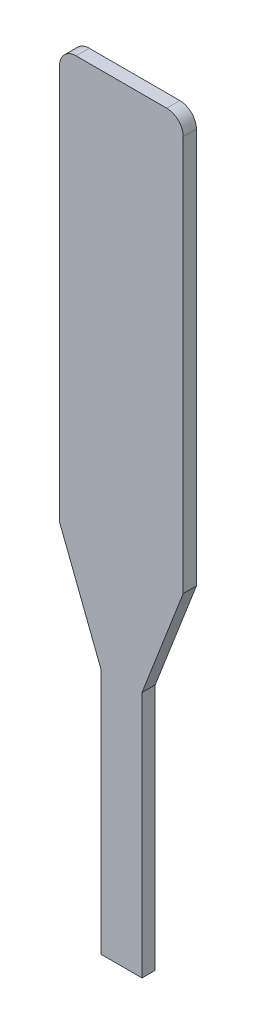
ISO-10303-21;
HEADER;
FILE_DESCRIPTION(('STEP AP214'),'2;1');
FILE_NAME('part.step','',(''),(''),'','','');
FILE_SCHEMA(('AUTOMOTIVE_DESIGN { 1 0 10303 214 1 1 1 1 }'));
ENDSEC;
DATA;
#1=APPLICATION_CONTEXT('core data for automotive mechanical design processes');
#2=APPLICATION_PROTOCOL_DEFINITION('international standard','automotive_design',2000,#1);
#3=PRODUCT_CONTEXT('',#1,'mechanical');
#4=PRODUCT('Part','Part','',(#3));
#5=PRODUCT_RELATED_PRODUCT_CATEGORY('part','',(#4));
#6=PRODUCT_DEFINITION_FORMATION('','',#4);
#7=PRODUCT_DEFINITION_CONTEXT('part definition',#1,'design');
#8=PRODUCT_DEFINITION('design','',#6,#7);
#9=PRODUCT_DEFINITION_SHAPE('','',#8);
#10=(LENGTH_UNIT() NAMED_UNIT(*) SI_UNIT(.MILLI.,.METRE.));
#11=(NAMED_UNIT(*) PLANE_ANGLE_UNIT() SI_UNIT($,.RADIAN.));
#12=(NAMED_UNIT(*) SI_UNIT($,.STERADIAN.) SOLID_ANGLE_UNIT());
#13=UNCERTAINTY_MEASURE_WITH_UNIT(LENGTH_MEASURE(1.E-05),#10,'distance_accuracy_value','');
#14=(GEOMETRIC_REPRESENTATION_CONTEXT(3) GLOBAL_UNCERTAINTY_ASSIGNED_CONTEXT((#13)) GLOBAL_UNIT_ASSIGNED_CONTEXT((#10,
#11,#12)) REPRESENTATION_CONTEXT('',''));
#15=CARTESIAN_POINT('',(0.,0.,0.));
#16=DIRECTION('',(0.,0.,1.));
#17=DIRECTION('',(1.,0.,0.));
#18=AXIS2_PLACEMENT_3D('',#15,#16,#17);
#19=CARTESIAN_POINT('',(-49.1053468890321,-47.93024814412,0.2032));
#20=DIRECTION('',(1.,0.,0.));
#21=DIRECTION('',(0.,0.,-1.));
#22=AXIS2_PLACEMENT_3D('',#19,#20,#21);
#23=PLANE('',#22);
#24=DIRECTION('',(0.,-1.,0.));
#25=VECTOR('',#24,1.);
#26=CARTESIAN_POINT('',(-49.1053468890321,-47.93024814412,0.2032));
#27=LINE('',#26,#25);
#28=CARTESIAN_POINT('',(-49.1053468890321,-48.18424814412,0.2032));
#29=VERTEX_POINT('',#28);
#30=CARTESIAN_POINT('',(-49.1053468890321,-54.28024814412,0.2032));
#31=VERTEX_POINT('',#30);
#32=EDGE_CURVE('E111',#29,#31,#27,.T.);
#33=ORIENTED_EDGE('',*,*,#32,.F.);
#34=DIRECTION('',(0.,0.,-1.));
#35=VECTOR('',#34,1.);
#36=CARTESIAN_POINT('',(-49.1053468890321,-48.18424814412,0.2032));
#37=LINE('',#36,#35);
#38=CARTESIAN_POINT('',(-49.1053468890321,-48.18424814412,0.));
#39=VERTEX_POINT('',#38);
#40=EDGE_CURVE('E135',#29,#39,#37,.T.);
#41=ORIENTED_EDGE('',*,*,#40,.T.);
#42=DIRECTION('',(0.,-1.,0.));
#43=VECTOR('',#42,1.);
#44=CARTESIAN_POINT('',(-49.1053468890321,-47.93024814412,0.));
#45=LINE('',#44,#43);
#46=CARTESIAN_POINT('',(-49.1053468890321,-54.28024814412,0.));
#47=VERTEX_POINT('',#46);
#48=EDGE_CURVE('E133',#39,#47,#45,.T.);
#49=ORIENTED_EDGE('',*,*,#48,.T.);
#50=DIRECTION('',(0.,0.,-1.));
#51=VECTOR('',#50,1.);
#52=CARTESIAN_POINT('',(-49.1053468890321,-54.28024814412,0.2032));
#53=LINE('',#52,#51);
#54=EDGE_CURVE('E126',#31,#47,#53,.T.);
#55=ORIENTED_EDGE('',*,*,#54,.F.);
#56=EDGE_LOOP('',(#33,#41,#49,#55));
#57=FACE_BOUND('',#56,.T.);
#58=ADVANCED_FACE('F33',(#57),#23,.F.);
#59=CARTESIAN_POINT('',(-48.4703468890321,-55.9178218015101,0.2032));
#60=DIRECTION('',(0.932356998607198,0.361538970441883,0.));
#61=DIRECTION('',(-0.361538970441883,0.932356998607198,0.));
#62=AXIS2_PLACEMENT_3D('',#59,#60,#61);
#63=PLANE('',#62);
#64=DIRECTION('',(0.361538970441883,-0.932356998607198,0.));
#65=VECTOR('',#64,1.);
#66=CARTESIAN_POINT('',(-48.4703468890321,-55.9178218015101,0.));
#67=LINE('',#66,#65);
#68=CARTESIAN_POINT('',(-48.4703468890321,-55.9178218015101,0.));
#69=VERTEX_POINT('',#68);
#70=EDGE_CURVE('E195',#47,#69,#67,.T.);
#71=ORIENTED_EDGE('',*,*,#70,.T.);
#72=DIRECTION('',(0.,0.,-1.));
#73=VECTOR('',#72,1.);
#74=CARTESIAN_POINT('',(-48.4703468890321,-55.9178218015101,0.2032));
#75=LINE('',#74,#73);
#76=CARTESIAN_POINT('',(-48.4703468890321,-55.9178218015101,0.2032));
#77=VERTEX_POINT('',#76);
#78=EDGE_CURVE('E128',#77,#69,#75,.T.);
#79=ORIENTED_EDGE('',*,*,#78,.F.);
#80=DIRECTION('',(0.361538970441883,-0.932356998607198,0.));
#81=VECTOR('',#80,1.);
#82=CARTESIAN_POINT('',(-48.4703468890321,-55.9178218015101,0.2032));
#83=LINE('',#82,#81);
#84=EDGE_CURVE('E114',#31,#77,#83,.T.);
#85=ORIENTED_EDGE('',*,*,#84,.F.);
#86=ORIENTED_EDGE('',*,*,#54,.T.);
#87=EDGE_LOOP('',(#71,#79,#85,#86));
#88=FACE_BOUND('',#87,.T.);
#89=ADVANCED_FACE('F125',(#88),#63,.F.);
#90=CARTESIAN_POINT('',(-48.4703468890321,-59.7278218015101,0.2032));
#91=DIRECTION('',(1.,0.,0.));
#92=DIRECTION('',(0.,0.,-1.));
#93=AXIS2_PLACEMENT_3D('',#90,#91,#92);
#94=PLANE('',#93);
#95=DIRECTION('',(0.,-1.,0.));
#96=VECTOR('',#95,1.);
#97=CARTESIAN_POINT('',(-48.4703468890321,-59.7278218015101,0.));
#98=LINE('',#97,#96);
#99=CARTESIAN_POINT('',(-48.4703468890321,-59.7278218015101,0.));
#100=VERTEX_POINT('',#99);
#101=EDGE_CURVE('E193',#69,#100,#98,.T.);
#102=ORIENTED_EDGE('',*,*,#101,.T.);
#103=DIRECTION('',(0.,0.,-1.));
#104=VECTOR('',#103,1.);
#105=CARTESIAN_POINT('',(-48.4703468890321,-59.7278218015101,0.2032));
#106=LINE('',#105,#104);
#107=CARTESIAN_POINT('',(-48.4703468890321,-59.7278218015101,0.2032));
#108=VERTEX_POINT('',#107);
#109=EDGE_CURVE('E139',#108,#100,#106,.T.);
#110=ORIENTED_EDGE('',*,*,#109,.F.);
#111=DIRECTION('',(0.,-1.,0.));
#112=VECTOR('',#111,1.);
#113=CARTESIAN_POINT('',(-48.4703468890321,-59.7278218015101,0.2032));
#114=LINE('',#113,#112);
#115=EDGE_CURVE('E130',#77,#108,#114,.T.);
#116=ORIENTED_EDGE('',*,*,#115,.F.);
#117=ORIENTED_EDGE('',*,*,#78,.T.);
#118=EDGE_LOOP('',(#102,#110,#116,#117));
#119=FACE_BOUND('',#118,.T.);
#120=ADVANCED_FACE('F206',(#119),#94,.F.);
#121=CARTESIAN_POINT('',(-48.4703468890321,-59.7278218015101,0.2032));
#122=DIRECTION('',(0.,1.,0.));
#123=DIRECTION('',(0.,0.,1.));
#124=AXIS2_PLACEMENT_3D('',#121,#122,#123);
#125=PLANE('',#124);
#126=DIRECTION('',(1.,0.,0.));
#127=VECTOR('',#126,1.);
#128=CARTESIAN_POINT('',(-48.4703468890321,-59.7278218015101,0.));
#129=LINE('',#128,#127);
#130=CARTESIAN_POINT('',(-47.8353468890321,-59.7278218015101,0.));
#131=VERTEX_POINT('',#130);
#132=EDGE_CURVE('E188',#100,#131,#129,.T.);
#133=ORIENTED_EDGE('',*,*,#132,.T.);
#134=DIRECTION('',(0.,0.,-1.));
#135=VECTOR('',#134,1.);
#136=CARTESIAN_POINT('',(-47.8353468890321,-59.7278218015101,0.2032));
#137=LINE('',#136,#135);
#138=CARTESIAN_POINT('',(-47.8353468890321,-59.7278218015101,0.2032));
#139=VERTEX_POINT('',#138);
#140=EDGE_CURVE('E179',#139,#131,#137,.T.);
#141=ORIENTED_EDGE('',*,*,#140,.F.);
#142=DIRECTION('',(1.,0.,0.));
#143=VECTOR('',#142,1.);
#144=CARTESIAN_POINT('',(-48.4703468890321,-59.7278218015101,0.2032));
#145=LINE('',#144,#143);
#146=EDGE_CURVE('E189',#108,#139,#145,.T.);
#147=ORIENTED_EDGE('',*,*,#146,.F.);
#148=ORIENTED_EDGE('',*,*,#109,.T.);
#149=EDGE_LOOP('',(#133,#141,#147,#148));
#150=FACE_BOUND('',#149,.T.);
#151=ADVANCED_FACE('F186',(#150),#125,.F.);
#152=CARTESIAN_POINT('',(-47.8353468890321,-59.7278218015101,0.2032));
#153=DIRECTION('',(-1.,0.,0.));
#154=DIRECTION('',(0.,0.,1.));
#155=AXIS2_PLACEMENT_3D('',#152,#153,#154);
#156=PLANE('',#155);
#157=DIRECTION('',(0.,1.,0.));
#158=VECTOR('',#157,1.);
#159=CARTESIAN_POINT('',(-47.8353468890321,-59.7278218015101,0.));
#160=LINE('',#159,#158);
#161=CARTESIAN_POINT('',(-47.8353468890321,-55.9178218015101,0.));
#162=VERTEX_POINT('',#161);
#163=EDGE_CURVE('E171',#131,#162,#160,.T.);
#164=ORIENTED_EDGE('',*,*,#163,.T.);
#165=DIRECTION('',(0.,0.,-1.));
#166=VECTOR('',#165,1.);
#167=CARTESIAN_POINT('',(-47.8353468890321,-55.9178218015101,0.2032));
#168=LINE('',#167,#166);
#169=CARTESIAN_POINT('',(-47.8353468890321,-55.9178218015101,0.2032));
#170=VERTEX_POINT('',#169);
#171=EDGE_CURVE('E176',#170,#162,#168,.T.);
#172=ORIENTED_EDGE('',*,*,#171,.F.);
#173=DIRECTION('',(0.,1.,0.));
#174=VECTOR('',#173,1.);
#175=CARTESIAN_POINT('',(-47.8353468890321,-59.7278218015101,0.2032));
#176=LINE('',#175,#174);
#177=EDGE_CURVE('E203',#139,#170,#176,.T.);
#178=ORIENTED_EDGE('',*,*,#177,.F.);
#179=ORIENTED_EDGE('',*,*,#140,.T.);
#180=EDGE_LOOP('',(#164,#172,#178,#179));
#181=FACE_BOUND('',#180,.T.);
#182=ADVANCED_FACE('F213',(#181),#156,.F.);
#183=CARTESIAN_POINT('',(-47.8353468890321,-55.9178218015101,0.2032));
#184=DIRECTION('',(-0.932356998607197,0.361538970441887,0.));
#185=DIRECTION('',(-0.361538970441887,-0.932356998607197,0.));
#186=AXIS2_PLACEMENT_3D('',#183,#184,#185);
#187=PLANE('',#186);
#188=DIRECTION('',(0.361538970441887,0.932356998607197,0.));
#189=VECTOR('',#188,1.);
#190=CARTESIAN_POINT('',(-47.8353468890321,-55.9178218015101,0.));
#191=LINE('',#190,#189);
#192=CARTESIAN_POINT('',(-47.2003468890321,-54.28024814412,0.));
#193=VERTEX_POINT('',#192);
#194=EDGE_CURVE('E168',#162,#193,#191,.T.);
#195=ORIENTED_EDGE('',*,*,#194,.T.);
#196=DIRECTION('',(0.,0.,-1.));
#197=VECTOR('',#196,1.);
#198=CARTESIAN_POINT('',(-47.2003468890321,-54.28024814412,0.2032));
#199=LINE('',#198,#197);
#200=CARTESIAN_POINT('',(-47.2003468890321,-54.28024814412,0.2032));
#201=VERTEX_POINT('',#200);
#202=EDGE_CURVE('E158',#201,#193,#199,.T.);
#203=ORIENTED_EDGE('',*,*,#202,.F.);
#204=DIRECTION('',(0.361538970441887,0.932356998607197,0.));
#205=VECTOR('',#204,1.);
#206=CARTESIAN_POINT('',(-47.8353468890321,-55.9178218015101,0.2032));
#207=LINE('',#206,#205);
#208=EDGE_CURVE('E201',#170,#201,#207,.T.);
#209=ORIENTED_EDGE('',*,*,#208,.F.);
#210=ORIENTED_EDGE('',*,*,#171,.T.);
#211=EDGE_LOOP('',(#195,#203,#209,#210));
#212=FACE_BOUND('',#211,.T.);
#213=ADVANCED_FACE('F237',(#212),#187,.F.);
#214=CARTESIAN_POINT('',(-47.2003468890321,-54.28024814412,0.2032));
#215=DIRECTION('',(-1.,0.,0.));
#216=DIRECTION('',(0.,0.,1.));
#217=AXIS2_PLACEMENT_3D('',#214,#215,#216);
#218=PLANE('',#217);
#219=DIRECTION('',(0.,1.,0.));
#220=VECTOR('',#219,1.);
#221=CARTESIAN_POINT('',(-47.2003468890321,-54.28024814412,0.));
#222=LINE('',#221,#220);
#223=CARTESIAN_POINT('',(-47.2003468890321,-48.18424814412,0.));
#224=VERTEX_POINT('',#223);
#225=EDGE_CURVE('E164',#193,#224,#222,.T.);
#226=ORIENTED_EDGE('',*,*,#225,.T.);
#227=DIRECTION('',(0.,0.,-1.));
#228=VECTOR('',#227,1.);
#229=CARTESIAN_POINT('',(-47.2003468890321,-48.18424814412,0.2032));
#230=LINE('',#229,#228);
#231=CARTESIAN_POINT('',(-47.2003468890321,-48.18424814412,0.2032));
#232=VERTEX_POINT('',#231);
#233=EDGE_CURVE('E11',#224,#232,#230,.F.);
#234=ORIENTED_EDGE('',*,*,#233,.T.);
#235=DIRECTION('',(0.,1.,0.));
#236=VECTOR('',#235,1.);
#237=CARTESIAN_POINT('',(-47.2003468890321,-54.28024814412,0.2032));
#238=LINE('',#237,#236);
#239=EDGE_CURVE('E153',#201,#232,#238,.T.);
#240=ORIENTED_EDGE('',*,*,#239,.F.);
#241=ORIENTED_EDGE('',*,*,#202,.T.);
#242=EDGE_LOOP('',(#226,#234,#240,#241));
#243=FACE_BOUND('',#242,.T.);
#244=ADVANCED_FACE('F166',(#243),#218,.F.);
#245=CARTESIAN_POINT('',(-49.1053468890321,-47.93024814412,0.2032));
#246=DIRECTION('',(0.,-1.,0.));
#247=DIRECTION('',(0.,0.,-1.));
#248=AXIS2_PLACEMENT_3D('',#245,#246,#247);
#249=PLANE('',#248);
#250=DIRECTION('',(-1.,0.,0.));
#251=VECTOR('',#250,1.);
#252=CARTESIAN_POINT('',(-49.1053468890321,-47.93024814412,0.));
#253=LINE('',#252,#251);
#254=CARTESIAN_POINT('',(-47.4543468890321,-47.93024814412,0.));
#255=VERTEX_POINT('',#254);
#256=CARTESIAN_POINT('',(-48.8513468890321,-47.93024814412,0.));
#257=VERTEX_POINT('',#256);
#258=EDGE_CURVE('E121',#255,#257,#253,.T.);
#259=ORIENTED_EDGE('',*,*,#258,.T.);
#260=DIRECTION('',(0.,0.,-1.));
#261=VECTOR('',#260,1.);
#262=CARTESIAN_POINT('',(-48.8513468890321,-47.93024814412,0.2032));
#263=LINE('',#262,#261);
#264=CARTESIAN_POINT('',(-48.8513468890321,-47.93024814412,0.2032));
#265=VERTEX_POINT('',#264);
#266=EDGE_CURVE('E54',#257,#265,#263,.F.);
#267=ORIENTED_EDGE('',*,*,#266,.T.);
#268=DIRECTION('',(-1.,0.,0.));
#269=VECTOR('',#268,1.);
#270=CARTESIAN_POINT('',(-49.1053468890321,-47.93024814412,0.2032));
#271=LINE('',#270,#269);
#272=CARTESIAN_POINT('',(-47.4543468890321,-47.93024814412,0.2032));
#273=VERTEX_POINT('',#272);
#274=EDGE_CURVE('E152',#273,#265,#271,.T.);
#275=ORIENTED_EDGE('',*,*,#274,.F.);
#276=DIRECTION('',(0.,0.,-1.));
#277=VECTOR('',#276,1.);
#278=CARTESIAN_POINT('',(-47.4543468890321,-47.93024814412,0.2032));
#279=LINE('',#278,#277);
#280=EDGE_CURVE('E146',#273,#255,#279,.T.);
#281=ORIENTED_EDGE('',*,*,#280,.T.);
#282=EDGE_LOOP('',(#259,#267,#275,#281));
#283=FACE_BOUND('',#282,.T.);
#284=ADVANCED_FACE('F156',(#283),#249,.F.);
#285=CARTESIAN_POINT('',(0.,0.,0.2032));
#286=DIRECTION('',(0.,0.,1.));
#287=DIRECTION('',(1.,0.,0.));
#288=AXIS2_PLACEMENT_3D('',#285,#286,#287);
#289=PLANE('',#288);
#290=ORIENTED_EDGE('',*,*,#274,.T.);
#291=CARTESIAN_POINT('',(-48.8513468890321,-48.18424814412,0.2032));
#292=DIRECTION('',(0.,0.,1.));
#293=DIRECTION('',(1.,0.,0.));
#294=AXIS2_PLACEMENT_3D('',#291,#292,#293);
#295=CIRCLE('',#294,0.254);
#296=EDGE_CURVE('E41',#265,#29,#295,.T.);
#297=ORIENTED_EDGE('',*,*,#296,.T.);
#298=ORIENTED_EDGE('',*,*,#32,.T.);
#299=ORIENTED_EDGE('',*,*,#84,.T.);
#300=ORIENTED_EDGE('',*,*,#115,.T.);
#301=ORIENTED_EDGE('',*,*,#146,.T.);
#302=ORIENTED_EDGE('',*,*,#177,.T.);
#303=ORIENTED_EDGE('',*,*,#208,.T.);
#304=ORIENTED_EDGE('',*,*,#239,.T.);
#305=CARTESIAN_POINT('',(-47.4543468890321,-48.18424814412,0.2032));
#306=DIRECTION('',(0.,0.,1.));
#307=DIRECTION('',(1.,0.,0.));
#308=AXIS2_PLACEMENT_3D('',#305,#306,#307);
#309=CIRCLE('',#308,0.254);
#310=EDGE_CURVE('E150',#232,#273,#309,.T.);
#311=ORIENTED_EDGE('',*,*,#310,.T.);
#312=EDGE_LOOP('',(#290,#297,#298,#299,#300,#301,#302,#303,#304,#311));
#313=FACE_BOUND('',#312,.T.);
#314=ADVANCED_FACE('F113',(#313),#289,.T.);
#315=CARTESIAN_POINT('',(0.,0.,0.));
#316=DIRECTION('',(0.,0.,1.));
#317=DIRECTION('',(1.,0.,0.));
#318=AXIS2_PLACEMENT_3D('',#315,#316,#317);
#319=PLANE('',#318);
#320=ORIENTED_EDGE('',*,*,#48,.F.);
#321=CARTESIAN_POINT('',(-48.8513468890321,-48.18424814412,0.));
#322=DIRECTION('',(0.,0.,1.));
#323=DIRECTION('',(1.,0.,0.));
#324=AXIS2_PLACEMENT_3D('',#321,#322,#323);
#325=CIRCLE('',#324,0.254);
#326=EDGE_CURVE('E144',#39,#257,#325,.F.);
#327=ORIENTED_EDGE('',*,*,#326,.T.);
#328=ORIENTED_EDGE('',*,*,#258,.F.);
#329=CARTESIAN_POINT('',(-47.4543468890321,-48.18424814412,0.));
#330=DIRECTION('',(0.,0.,1.));
#331=DIRECTION('',(1.,0.,0.));
#332=AXIS2_PLACEMENT_3D('',#329,#330,#331);
#333=CIRCLE('',#332,0.254);
#334=EDGE_CURVE('E137',#255,#224,#333,.F.);
#335=ORIENTED_EDGE('',*,*,#334,.T.);
#336=ORIENTED_EDGE('',*,*,#225,.F.);
#337=ORIENTED_EDGE('',*,*,#194,.F.);
#338=ORIENTED_EDGE('',*,*,#163,.F.);
#339=ORIENTED_EDGE('',*,*,#132,.F.);
#340=ORIENTED_EDGE('',*,*,#101,.F.);
#341=ORIENTED_EDGE('',*,*,#70,.F.);
#342=EDGE_LOOP('',(#320,#327,#328,#335,#336,#337,#338,#339,#340,#341));
#343=FACE_BOUND('',#342,.T.);
#344=ADVANCED_FACE('F162',(#343),#319,.F.);
#345=CARTESIAN_POINT('',(-48.8513468890321,-48.18424814412,0.2032));
#346=DIRECTION('',(0.,0.,-1.));
#347=DIRECTION('',(-1.,0.,0.));
#348=AXIS2_PLACEMENT_3D('',#345,#346,#347);
#349=CYLINDRICAL_SURFACE('',#348,0.254);
#350=ORIENTED_EDGE('',*,*,#296,.F.);
#351=ORIENTED_EDGE('',*,*,#266,.F.);
#352=ORIENTED_EDGE('',*,*,#326,.F.);
#353=ORIENTED_EDGE('',*,*,#40,.F.);
#354=EDGE_LOOP('',(#350,#351,#352,#353));
#355=FACE_BOUND('',#354,.T.);
#356=ADVANCED_FACE('F220',(#355),#349,.T.);
#357=CARTESIAN_POINT('',(-47.4543468890321,-48.18424814412,0.2032));
#358=DIRECTION('',(0.,0.,-1.));
#359=DIRECTION('',(-1.,0.,0.));
#360=AXIS2_PLACEMENT_3D('',#357,#358,#359);
#361=CYLINDRICAL_SURFACE('',#360,0.254);
#362=ORIENTED_EDGE('',*,*,#310,.F.);
#363=ORIENTED_EDGE('',*,*,#233,.F.);
#364=ORIENTED_EDGE('',*,*,#334,.F.);
#365=ORIENTED_EDGE('',*,*,#280,.F.);
#366=EDGE_LOOP('',(#362,#363,#364,#365));
#367=FACE_BOUND('',#366,.T.);
#368=ADVANCED_FACE('F35',(#367),#361,.T.);
#369=CLOSED_SHELL('',(#58,#89,#120,#151,#182,#213,#244,#284,#314,#344,#356,#368));
#370=MANIFOLD_SOLID_BREP('B2',#369);
#371=ADVANCED_BREP_SHAPE_REPRESENTATION('',(#18,#370),#14);
#372=SHAPE_DEFINITION_REPRESENTATION(#9,#371);
ENDSEC;
END-ISO-10303-21;
